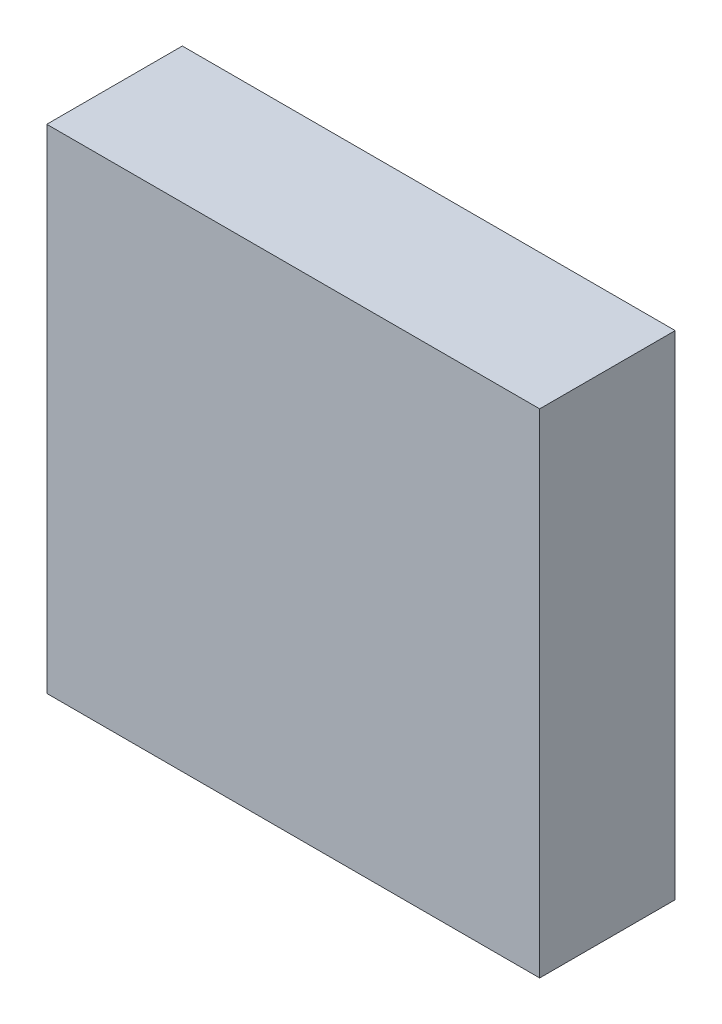
ISO-10303-21;
HEADER;
FILE_DESCRIPTION(('STEP AP214'),'2;1');
FILE_NAME('part.step','',(''),(''),'','','');
FILE_SCHEMA(('AUTOMOTIVE_DESIGN { 1 0 10303 214 1 1 1 1 }'));
ENDSEC;
DATA;
#1=APPLICATION_CONTEXT('core data for automotive mechanical design processes');
#2=APPLICATION_PROTOCOL_DEFINITION('international standard','automotive_design',2000,#1);
#3=PRODUCT_CONTEXT('',#1,'mechanical');
#4=PRODUCT('Part','Part','',(#3));
#5=PRODUCT_RELATED_PRODUCT_CATEGORY('part','',(#4));
#6=PRODUCT_DEFINITION_FORMATION('','',#4);
#7=PRODUCT_DEFINITION_CONTEXT('part definition',#1,'design');
#8=PRODUCT_DEFINITION('design','',#6,#7);
#9=PRODUCT_DEFINITION_SHAPE('','',#8);
#10=(LENGTH_UNIT() NAMED_UNIT(*) SI_UNIT(.MILLI.,.METRE.));
#11=(NAMED_UNIT(*) PLANE_ANGLE_UNIT() SI_UNIT($,.RADIAN.));
#12=(NAMED_UNIT(*) SI_UNIT($,.STERADIAN.) SOLID_ANGLE_UNIT());
#13=UNCERTAINTY_MEASURE_WITH_UNIT(LENGTH_MEASURE(1.E-05),#10,'distance_accuracy_value','');
#14=(GEOMETRIC_REPRESENTATION_CONTEXT(3) GLOBAL_UNCERTAINTY_ASSIGNED_CONTEXT((#13)) GLOBAL_UNIT_ASSIGNED_CONTEXT((#10,
#11,#12)) REPRESENTATION_CONTEXT('',''));
#15=CARTESIAN_POINT('',(0.,0.,0.));
#16=DIRECTION('',(0.,0.,1.));
#17=DIRECTION('',(1.,0.,0.));
#18=AXIS2_PLACEMENT_3D('',#15,#16,#17);
#19=CARTESIAN_POINT('',(0.,0.,1.1));
#20=DIRECTION('',(1.,0.,0.));
#21=DIRECTION('',(0.,0.,-1.));
#22=AXIS2_PLACEMENT_3D('',#19,#20,#21);
#23=PLANE('',#22);
#24=DIRECTION('',(0.,-1.,0.));
#25=VECTOR('',#24,1.);
#26=CARTESIAN_POINT('',(0.,0.,0.));
#27=LINE('',#26,#25);
#28=CARTESIAN_POINT('',(0.,4.,0.));
#29=VERTEX_POINT('',#28);
#30=CARTESIAN_POINT('',(0.,0.,0.));
#31=VERTEX_POINT('',#30);
#32=EDGE_CURVE('E98',#29,#31,#27,.T.);
#33=ORIENTED_EDGE('',*,*,#32,.T.);
#34=DIRECTION('',(0.,0.,-1.));
#35=VECTOR('',#34,1.);
#36=CARTESIAN_POINT('',(0.,0.,1.1));
#37=LINE('',#36,#35);
#38=CARTESIAN_POINT('',(0.,0.,1.1));
#39=VERTEX_POINT('',#38);
#40=EDGE_CURVE('E11',#39,#31,#37,.T.);
#41=ORIENTED_EDGE('',*,*,#40,.F.);
#42=DIRECTION('',(0.,-1.,0.));
#43=VECTOR('',#42,1.);
#44=CARTESIAN_POINT('',(0.,0.,1.1));
#45=LINE('',#44,#43);
#46=CARTESIAN_POINT('',(0.,4.,1.1));
#47=VERTEX_POINT('',#46);
#48=EDGE_CURVE('E86',#47,#39,#45,.T.);
#49=ORIENTED_EDGE('',*,*,#48,.F.);
#50=DIRECTION('',(0.,0.,-1.));
#51=VECTOR('',#50,1.);
#52=CARTESIAN_POINT('',(0.,4.,1.1));
#53=LINE('',#52,#51);
#54=EDGE_CURVE('E94',#47,#29,#53,.T.);
#55=ORIENTED_EDGE('',*,*,#54,.T.);
#56=EDGE_LOOP('',(#33,#41,#49,#55));
#57=FACE_BOUND('',#56,.T.);
#58=ADVANCED_FACE('F35',(#57),#23,.F.);
#59=CARTESIAN_POINT('',(0.,0.,1.1));
#60=DIRECTION('',(0.,1.,0.));
#61=DIRECTION('',(0.,0.,1.));
#62=AXIS2_PLACEMENT_3D('',#59,#60,#61);
#63=PLANE('',#62);
#64=DIRECTION('',(1.,0.,0.));
#65=VECTOR('',#64,1.);
#66=CARTESIAN_POINT('',(0.,0.,0.));
#67=LINE('',#66,#65);
#68=CARTESIAN_POINT('',(4.,0.,0.));
#69=VERTEX_POINT('',#68);
#70=EDGE_CURVE('E90',#31,#69,#67,.T.);
#71=ORIENTED_EDGE('',*,*,#70,.T.);
#72=DIRECTION('',(0.,0.,-1.));
#73=VECTOR('',#72,1.);
#74=CARTESIAN_POINT('',(4.,0.,1.1));
#75=LINE('',#74,#73);
#76=CARTESIAN_POINT('',(4.,0.,1.1));
#77=VERTEX_POINT('',#76);
#78=EDGE_CURVE('E43',#77,#69,#75,.T.);
#79=ORIENTED_EDGE('',*,*,#78,.F.);
#80=DIRECTION('',(1.,0.,0.));
#81=VECTOR('',#80,1.);
#82=CARTESIAN_POINT('',(0.,0.,1.1));
#83=LINE('',#82,#81);
#84=EDGE_CURVE('E81',#39,#77,#83,.T.);
#85=ORIENTED_EDGE('',*,*,#84,.F.);
#86=ORIENTED_EDGE('',*,*,#40,.T.);
#87=EDGE_LOOP('',(#71,#79,#85,#86));
#88=FACE_BOUND('',#87,.T.);
#89=ADVANCED_FACE('F89',(#88),#63,.F.);
#90=CARTESIAN_POINT('',(4.,0.,1.1));
#91=DIRECTION('',(-1.,0.,0.));
#92=DIRECTION('',(0.,0.,1.));
#93=AXIS2_PLACEMENT_3D('',#90,#91,#92);
#94=PLANE('',#93);
#95=DIRECTION('',(0.,1.,0.));
#96=VECTOR('',#95,1.);
#97=CARTESIAN_POINT('',(4.,0.,0.));
#98=LINE('',#97,#96);
#99=CARTESIAN_POINT('',(4.,4.,0.));
#100=VERTEX_POINT('',#99);
#101=EDGE_CURVE('E68',#69,#100,#98,.T.);
#102=ORIENTED_EDGE('',*,*,#101,.T.);
#103=DIRECTION('',(0.,0.,-1.));
#104=VECTOR('',#103,1.);
#105=CARTESIAN_POINT('',(4.,4.,1.1));
#106=LINE('',#105,#104);
#107=CARTESIAN_POINT('',(4.,4.,1.1));
#108=VERTEX_POINT('',#107);
#109=EDGE_CURVE('E91',#108,#100,#106,.T.);
#110=ORIENTED_EDGE('',*,*,#109,.F.);
#111=DIRECTION('',(0.,1.,0.));
#112=VECTOR('',#111,1.);
#113=CARTESIAN_POINT('',(4.,0.,1.1));
#114=LINE('',#113,#112);
#115=EDGE_CURVE('E84',#77,#108,#114,.T.);
#116=ORIENTED_EDGE('',*,*,#115,.F.);
#117=ORIENTED_EDGE('',*,*,#78,.T.);
#118=EDGE_LOOP('',(#102,#110,#116,#117));
#119=FACE_BOUND('',#118,.T.);
#120=ADVANCED_FACE('F92',(#119),#94,.F.);
#121=CARTESIAN_POINT('',(0.,4.,1.1));
#122=DIRECTION('',(0.,-1.,0.));
#123=DIRECTION('',(0.,0.,-1.));
#124=AXIS2_PLACEMENT_3D('',#121,#122,#123);
#125=PLANE('',#124);
#126=DIRECTION('',(-1.,0.,0.));
#127=VECTOR('',#126,1.);
#128=CARTESIAN_POINT('',(0.,4.,0.));
#129=LINE('',#128,#127);
#130=EDGE_CURVE('E74',#100,#29,#129,.T.);
#131=ORIENTED_EDGE('',*,*,#130,.T.);
#132=ORIENTED_EDGE('',*,*,#54,.F.);
#133=DIRECTION('',(-1.,0.,0.));
#134=VECTOR('',#133,1.);
#135=CARTESIAN_POINT('',(0.,4.,1.1));
#136=LINE('',#135,#134);
#137=EDGE_CURVE('E51',#108,#47,#136,.T.);
#138=ORIENTED_EDGE('',*,*,#137,.F.);
#139=ORIENTED_EDGE('',*,*,#109,.T.);
#140=EDGE_LOOP('',(#131,#132,#138,#139));
#141=FACE_BOUND('',#140,.T.);
#142=ADVANCED_FACE('F105',(#141),#125,.F.);
#143=CARTESIAN_POINT('',(0.,0.,1.1));
#144=DIRECTION('',(0.,0.,-1.));
#145=DIRECTION('',(-1.,0.,0.));
#146=AXIS2_PLACEMENT_3D('',#143,#144,#145);
#147=PLANE('',#146);
#148=ORIENTED_EDGE('',*,*,#48,.T.);
#149=ORIENTED_EDGE('',*,*,#84,.T.);
#150=ORIENTED_EDGE('',*,*,#115,.T.);
#151=ORIENTED_EDGE('',*,*,#137,.T.);
#152=EDGE_LOOP('',(#148,#149,#150,#151));
#153=FACE_BOUND('',#152,.T.);
#154=ADVANCED_FACE('F82',(#153),#147,.F.);
#155=CARTESIAN_POINT('',(0.,0.,0.));
#156=DIRECTION('',(0.,0.,-1.));
#157=DIRECTION('',(-1.,0.,0.));
#158=AXIS2_PLACEMENT_3D('',#155,#156,#157);
#159=PLANE('',#158);
#160=ORIENTED_EDGE('',*,*,#32,.F.);
#161=ORIENTED_EDGE('',*,*,#130,.F.);
#162=ORIENTED_EDGE('',*,*,#101,.F.);
#163=ORIENTED_EDGE('',*,*,#70,.F.);
#164=EDGE_LOOP('',(#160,#161,#162,#163));
#165=FACE_BOUND('',#164,.T.);
#166=ADVANCED_FACE('F108',(#165),#159,.T.);
#167=CLOSED_SHELL('',(#58,#89,#120,#142,#154,#166));
#168=MANIFOLD_SOLID_BREP('B2',#167);
#169=ADVANCED_BREP_SHAPE_REPRESENTATION('',(#18,#168),#14);
#170=SHAPE_DEFINITION_REPRESENTATION(#9,#169);
ENDSEC;
END-ISO-10303-21;
